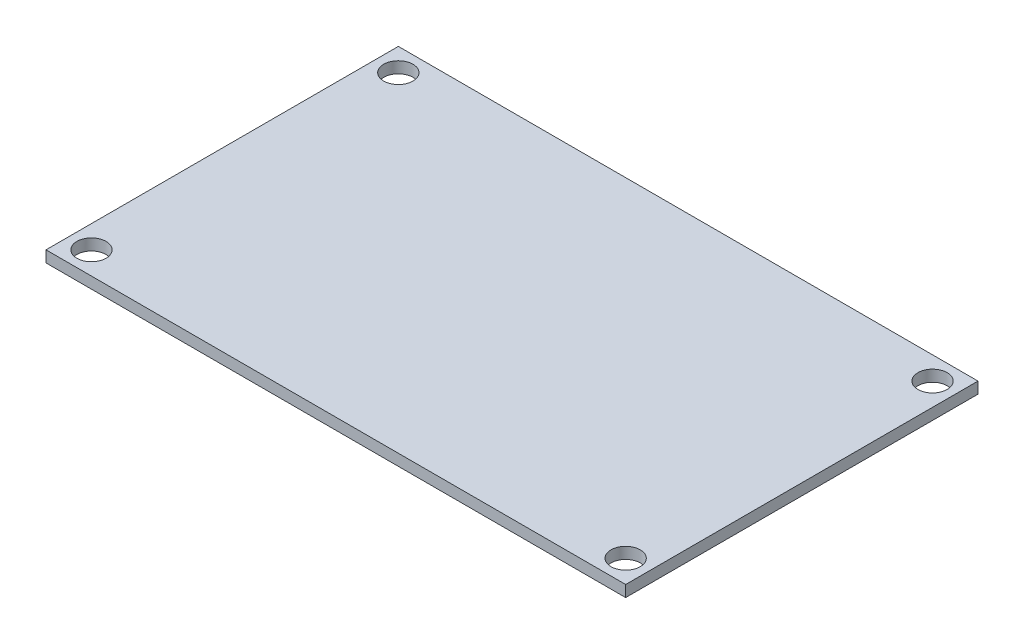
ISO-10303-21;
HEADER;
FILE_DESCRIPTION(('STEP AP214'),'2;1');
FILE_NAME('part.step','',(''),(''),'','','');
FILE_SCHEMA(('AUTOMOTIVE_DESIGN { 1 0 10303 214 1 1 1 1 }'));
ENDSEC;
DATA;
#1=APPLICATION_CONTEXT('core data for automotive mechanical design processes');
#2=APPLICATION_PROTOCOL_DEFINITION('international standard','automotive_design',2000,#1);
#3=PRODUCT_CONTEXT('',#1,'mechanical');
#4=PRODUCT('Part','Part','',(#3));
#5=PRODUCT_RELATED_PRODUCT_CATEGORY('part','',(#4));
#6=PRODUCT_DEFINITION_FORMATION('','',#4);
#7=PRODUCT_DEFINITION_CONTEXT('part definition',#1,'design');
#8=PRODUCT_DEFINITION('design','',#6,#7);
#9=PRODUCT_DEFINITION_SHAPE('','',#8);
#10=(LENGTH_UNIT() NAMED_UNIT(*) SI_UNIT(.MILLI.,.METRE.));
#11=(NAMED_UNIT(*) PLANE_ANGLE_UNIT() SI_UNIT($,.RADIAN.));
#12=(NAMED_UNIT(*) SI_UNIT($,.STERADIAN.) SOLID_ANGLE_UNIT());
#13=UNCERTAINTY_MEASURE_WITH_UNIT(LENGTH_MEASURE(1.E-05),#10,'distance_accuracy_value','');
#14=(GEOMETRIC_REPRESENTATION_CONTEXT(3) GLOBAL_UNCERTAINTY_ASSIGNED_CONTEXT((#13)) GLOBAL_UNIT_ASSIGNED_CONTEXT((#10,
#11,#12)) REPRESENTATION_CONTEXT('',''));
#15=CARTESIAN_POINT('',(0.,0.,0.));
#16=DIRECTION('',(0.,0.,1.));
#17=DIRECTION('',(1.,0.,0.));
#18=AXIS2_PLACEMENT_3D('',#15,#16,#17);
#19=CARTESIAN_POINT('',(32.385,1.27,19.685));
#20=DIRECTION('',(-1.,0.,0.));
#21=DIRECTION('',(0.,0.,1.));
#22=AXIS2_PLACEMENT_3D('',#19,#20,#21);
#23=PLANE('',#22);
#24=DIRECTION('',(0.,0.,-1.));
#25=VECTOR('',#24,1.);
#26=CARTESIAN_POINT('',(32.385,0.,19.685));
#27=LINE('',#26,#25);
#28=CARTESIAN_POINT('',(32.385,0.,19.685));
#29=VERTEX_POINT('',#28);
#30=CARTESIAN_POINT('',(32.385,0.,-19.685));
#31=VERTEX_POINT('',#30);
#32=EDGE_CURVE('E97',#29,#31,#27,.T.);
#33=ORIENTED_EDGE('',*,*,#32,.T.);
#34=DIRECTION('',(0.,-1.,0.));
#35=VECTOR('',#34,1.);
#36=CARTESIAN_POINT('',(32.385,1.27,-19.685));
#37=LINE('',#36,#35);
#38=CARTESIAN_POINT('',(32.385,1.27,-19.685));
#39=VERTEX_POINT('',#38);
#40=EDGE_CURVE('E11',#39,#31,#37,.T.);
#41=ORIENTED_EDGE('',*,*,#40,.F.);
#42=DIRECTION('',(0.,0.,-1.));
#43=VECTOR('',#42,1.);
#44=CARTESIAN_POINT('',(32.385,1.27,19.685));
#45=LINE('',#44,#43);
#46=CARTESIAN_POINT('',(32.385,1.27,19.685));
#47=VERTEX_POINT('',#46);
#48=EDGE_CURVE('E84',#47,#39,#45,.T.);
#49=ORIENTED_EDGE('',*,*,#48,.F.);
#50=DIRECTION('',(0.,-1.,0.));
#51=VECTOR('',#50,1.);
#52=CARTESIAN_POINT('',(32.385,1.27,19.685));
#53=LINE('',#52,#51);
#54=EDGE_CURVE('E93',#47,#29,#53,.T.);
#55=ORIENTED_EDGE('',*,*,#54,.T.);
#56=EDGE_LOOP('',(#33,#41,#49,#55));
#57=FACE_BOUND('',#56,.T.);
#58=ADVANCED_FACE('F32',(#57),#23,.F.);
#59=CARTESIAN_POINT('',(-32.385,1.27,-19.685));
#60=DIRECTION('',(0.,0.,1.));
#61=DIRECTION('',(1.,0.,0.));
#62=AXIS2_PLACEMENT_3D('',#59,#60,#61);
#63=PLANE('',#62);
#64=DIRECTION('',(-1.,0.,0.));
#65=VECTOR('',#64,1.);
#66=CARTESIAN_POINT('',(-32.385,0.,-19.685));
#67=LINE('',#66,#65);
#68=CARTESIAN_POINT('',(-32.385,0.,-19.685));
#69=VERTEX_POINT('',#68);
#70=EDGE_CURVE('E88',#31,#69,#67,.T.);
#71=ORIENTED_EDGE('',*,*,#70,.T.);
#72=DIRECTION('',(0.,-1.,0.));
#73=VECTOR('',#72,1.);
#74=CARTESIAN_POINT('',(-32.385,1.27,-19.685));
#75=LINE('',#74,#73);
#76=CARTESIAN_POINT('',(-32.385,1.27,-19.685));
#77=VERTEX_POINT('',#76);
#78=EDGE_CURVE('E41',#77,#69,#75,.T.);
#79=ORIENTED_EDGE('',*,*,#78,.F.);
#80=DIRECTION('',(-1.,0.,0.));
#81=VECTOR('',#80,1.);
#82=CARTESIAN_POINT('',(-32.385,1.27,-19.685));
#83=LINE('',#82,#81);
#84=EDGE_CURVE('E79',#39,#77,#83,.T.);
#85=ORIENTED_EDGE('',*,*,#84,.F.);
#86=ORIENTED_EDGE('',*,*,#40,.T.);
#87=EDGE_LOOP('',(#71,#79,#85,#86));
#88=FACE_BOUND('',#87,.T.);
#89=ADVANCED_FACE('F87',(#88),#63,.F.);
#90=CARTESIAN_POINT('',(-32.385,1.27,19.685));
#91=DIRECTION('',(1.,0.,0.));
#92=DIRECTION('',(0.,0.,-1.));
#93=AXIS2_PLACEMENT_3D('',#90,#91,#92);
#94=PLANE('',#93);
#95=DIRECTION('',(0.,0.,1.));
#96=VECTOR('',#95,1.);
#97=CARTESIAN_POINT('',(-32.385,0.,19.685));
#98=LINE('',#97,#96);
#99=CARTESIAN_POINT('',(-32.385,0.,19.685));
#100=VERTEX_POINT('',#99);
#101=EDGE_CURVE('E66',#69,#100,#98,.T.);
#102=ORIENTED_EDGE('',*,*,#101,.T.);
#103=DIRECTION('',(0.,-1.,0.));
#104=VECTOR('',#103,1.);
#105=CARTESIAN_POINT('',(-32.385,1.27,19.685));
#106=LINE('',#105,#104);
#107=CARTESIAN_POINT('',(-32.385,1.27,19.685));
#108=VERTEX_POINT('',#107);
#109=EDGE_CURVE('E89',#108,#100,#106,.T.);
#110=ORIENTED_EDGE('',*,*,#109,.F.);
#111=DIRECTION('',(0.,0.,1.));
#112=VECTOR('',#111,1.);
#113=CARTESIAN_POINT('',(-32.385,1.27,19.685));
#114=LINE('',#113,#112);
#115=EDGE_CURVE('E82',#77,#108,#114,.T.);
#116=ORIENTED_EDGE('',*,*,#115,.F.);
#117=ORIENTED_EDGE('',*,*,#78,.T.);
#118=EDGE_LOOP('',(#102,#110,#116,#117));
#119=FACE_BOUND('',#118,.T.);
#120=ADVANCED_FACE('F91',(#119),#94,.F.);
#121=CARTESIAN_POINT('',(-32.385,1.27,19.685));
#122=DIRECTION('',(0.,0.,-1.));
#123=DIRECTION('',(-1.,0.,0.));
#124=AXIS2_PLACEMENT_3D('',#121,#122,#123);
#125=PLANE('',#124);
#126=DIRECTION('',(1.,0.,0.));
#127=VECTOR('',#126,1.);
#128=CARTESIAN_POINT('',(-32.385,0.,19.685));
#129=LINE('',#128,#127);
#130=EDGE_CURVE('E72',#100,#29,#129,.T.);
#131=ORIENTED_EDGE('',*,*,#130,.T.);
#132=ORIENTED_EDGE('',*,*,#54,.F.);
#133=DIRECTION('',(1.,0.,0.));
#134=VECTOR('',#133,1.);
#135=CARTESIAN_POINT('',(-32.385,1.27,19.685));
#136=LINE('',#135,#134);
#137=EDGE_CURVE('E49',#108,#47,#136,.T.);
#138=ORIENTED_EDGE('',*,*,#137,.F.);
#139=ORIENTED_EDGE('',*,*,#109,.T.);
#140=EDGE_LOOP('',(#131,#132,#138,#139));
#141=FACE_BOUND('',#140,.T.);
#142=ADVANCED_FACE('F105',(#141),#125,.F.);
#143=CARTESIAN_POINT('',(0.,1.27,0.));
#144=DIRECTION('',(0.,-1.,0.));
#145=DIRECTION('',(0.,0.,-1.));
#146=AXIS2_PLACEMENT_3D('',#143,#144,#145);
#147=PLANE('',#146);
#148=CARTESIAN_POINT('',(-29.845,1.27,-17.145));
#149=DIRECTION('',(0.,1.,0.));
#150=DIRECTION('',(0.,0.,1.));
#151=AXIS2_PLACEMENT_3D('',#148,#149,#150);
#152=CIRCLE('',#151,1.63195);
#153=CARTESIAN_POINT('',(-29.845,1.27,-15.51305));
#154=VERTEX_POINT('',#153);
#155=EDGE_CURVE('E128',#154,#154,#152,.T.);
#156=ORIENTED_EDGE('',*,*,#155,.F.);
#157=EDGE_LOOP('',(#156));
#158=FACE_BOUND('',#157,.T.);
#159=CARTESIAN_POINT('',(-29.845,1.27,17.145));
#160=DIRECTION('',(0.,1.,0.));
#161=DIRECTION('',(0.,0.,1.));
#162=AXIS2_PLACEMENT_3D('',#159,#160,#161);
#163=CIRCLE('',#162,1.63195);
#164=CARTESIAN_POINT('',(-29.845,1.27,18.77695));
#165=VERTEX_POINT('',#164);
#166=EDGE_CURVE('E122',#165,#165,#163,.T.);
#167=ORIENTED_EDGE('',*,*,#166,.F.);
#168=EDGE_LOOP('',(#167));
#169=FACE_BOUND('',#168,.T.);
#170=CARTESIAN_POINT('',(29.845,1.27,17.145));
#171=DIRECTION('',(0.,1.,0.));
#172=DIRECTION('',(0.,0.,1.));
#173=AXIS2_PLACEMENT_3D('',#170,#171,#172);
#174=CIRCLE('',#173,1.63195);
#175=CARTESIAN_POINT('',(29.845,1.27,18.77695));
#176=VERTEX_POINT('',#175);
#177=EDGE_CURVE('E119',#176,#176,#174,.T.);
#178=ORIENTED_EDGE('',*,*,#177,.F.);
#179=EDGE_LOOP('',(#178));
#180=FACE_BOUND('',#179,.T.);
#181=CARTESIAN_POINT('',(29.845,1.27,-17.145));
#182=DIRECTION('',(0.,1.,0.));
#183=DIRECTION('',(0.,0.,1.));
#184=AXIS2_PLACEMENT_3D('',#181,#182,#183);
#185=CIRCLE('',#184,1.63195);
#186=CARTESIAN_POINT('',(29.845,1.27,-15.51305));
#187=VERTEX_POINT('',#186);
#188=EDGE_CURVE('E113',#187,#187,#185,.T.);
#189=ORIENTED_EDGE('',*,*,#188,.F.);
#190=EDGE_LOOP('',(#189));
#191=FACE_BOUND('',#190,.T.);
#192=ORIENTED_EDGE('',*,*,#48,.T.);
#193=ORIENTED_EDGE('',*,*,#84,.T.);
#194=ORIENTED_EDGE('',*,*,#115,.T.);
#195=ORIENTED_EDGE('',*,*,#137,.T.);
#196=EDGE_LOOP('',(#192,#193,#194,#195));
#197=FACE_BOUND('',#196,.T.);
#198=ADVANCED_FACE('F80',(#158,#169,#180,#191,#197),#147,.F.);
#199=CARTESIAN_POINT('',(0.,0.,0.));
#200=DIRECTION('',(0.,-1.,0.));
#201=DIRECTION('',(0.,0.,-1.));
#202=AXIS2_PLACEMENT_3D('',#199,#200,#201);
#203=PLANE('',#202);
#204=CARTESIAN_POINT('',(-29.845,0.,-17.145));
#205=DIRECTION('',(0.,-1.,0.));
#206=DIRECTION('',(0.,0.,-1.));
#207=AXIS2_PLACEMENT_3D('',#204,#205,#206);
#208=CIRCLE('',#207,1.63195);
#209=CARTESIAN_POINT('',(-29.845,0.,-18.77695));
#210=VERTEX_POINT('',#209);
#211=EDGE_CURVE('E125',#210,#210,#208,.T.);
#212=ORIENTED_EDGE('',*,*,#211,.F.);
#213=EDGE_LOOP('',(#212));
#214=FACE_BOUND('',#213,.T.);
#215=CARTESIAN_POINT('',(-29.845,0.,17.145));
#216=DIRECTION('',(0.,-1.,0.));
#217=DIRECTION('',(0.,0.,-1.));
#218=AXIS2_PLACEMENT_3D('',#215,#216,#217);
#219=CIRCLE('',#218,1.63195);
#220=CARTESIAN_POINT('',(-29.845,0.,15.51305));
#221=VERTEX_POINT('',#220);
#222=EDGE_CURVE('E35',#221,#221,#219,.T.);
#223=ORIENTED_EDGE('',*,*,#222,.F.);
#224=EDGE_LOOP('',(#223));
#225=FACE_BOUND('',#224,.T.);
#226=CARTESIAN_POINT('',(29.845,0.,17.145));
#227=DIRECTION('',(0.,-1.,0.));
#228=DIRECTION('',(0.,0.,-1.));
#229=AXIS2_PLACEMENT_3D('',#226,#227,#228);
#230=CIRCLE('',#229,1.63195);
#231=CARTESIAN_POINT('',(29.845,0.,15.51305));
#232=VERTEX_POINT('',#231);
#233=EDGE_CURVE('E116',#232,#232,#230,.T.);
#234=ORIENTED_EDGE('',*,*,#233,.F.);
#235=EDGE_LOOP('',(#234));
#236=FACE_BOUND('',#235,.T.);
#237=CARTESIAN_POINT('',(29.845,0.,-17.145));
#238=DIRECTION('',(0.,-1.,0.));
#239=DIRECTION('',(0.,0.,-1.));
#240=AXIS2_PLACEMENT_3D('',#237,#238,#239);
#241=CIRCLE('',#240,1.63195);
#242=CARTESIAN_POINT('',(29.845,0.,-18.77695));
#243=VERTEX_POINT('',#242);
#244=EDGE_CURVE('E100',#243,#243,#241,.T.);
#245=ORIENTED_EDGE('',*,*,#244,.F.);
#246=EDGE_LOOP('',(#245));
#247=FACE_BOUND('',#246,.T.);
#248=ORIENTED_EDGE('',*,*,#32,.F.);
#249=ORIENTED_EDGE('',*,*,#130,.F.);
#250=ORIENTED_EDGE('',*,*,#101,.F.);
#251=ORIENTED_EDGE('',*,*,#70,.F.);
#252=EDGE_LOOP('',(#248,#249,#250,#251));
#253=FACE_BOUND('',#252,.T.);
#254=ADVANCED_FACE('F108',(#214,#225,#236,#247,#253),#203,.T.);
#255=CARTESIAN_POINT('',(29.845,1.27,-17.145));
#256=DIRECTION('',(0.,1.,0.));
#257=DIRECTION('',(0.,0.,1.));
#258=AXIS2_PLACEMENT_3D('',#255,#256,#257);
#259=CYLINDRICAL_SURFACE('',#258,1.63195);
#260=ORIENTED_EDGE('',*,*,#244,.T.);
#261=EDGE_LOOP('',(#260));
#262=FACE_BOUND('',#261,.T.);
#263=ORIENTED_EDGE('',*,*,#188,.T.);
#264=EDGE_LOOP('',(#263));
#265=FACE_BOUND('',#264,.T.);
#266=ADVANCED_FACE('F143',(#262,#265),#259,.F.);
#267=CARTESIAN_POINT('',(29.845,1.27,17.145));
#268=DIRECTION('',(0.,1.,0.));
#269=DIRECTION('',(0.,0.,1.));
#270=AXIS2_PLACEMENT_3D('',#267,#268,#269);
#271=CYLINDRICAL_SURFACE('',#270,1.63195);
#272=ORIENTED_EDGE('',*,*,#233,.T.);
#273=EDGE_LOOP('',(#272));
#274=FACE_BOUND('',#273,.T.);
#275=ORIENTED_EDGE('',*,*,#177,.T.);
#276=EDGE_LOOP('',(#275));
#277=FACE_BOUND('',#276,.T.);
#278=ADVANCED_FACE('F145',(#274,#277),#271,.F.);
#279=CARTESIAN_POINT('',(-29.845,1.27,17.145));
#280=DIRECTION('',(0.,1.,0.));
#281=DIRECTION('',(0.,0.,1.));
#282=AXIS2_PLACEMENT_3D('',#279,#280,#281);
#283=CYLINDRICAL_SURFACE('',#282,1.63195);
#284=ORIENTED_EDGE('',*,*,#222,.T.);
#285=EDGE_LOOP('',(#284));
#286=FACE_BOUND('',#285,.T.);
#287=ORIENTED_EDGE('',*,*,#166,.T.);
#288=EDGE_LOOP('',(#287));
#289=FACE_BOUND('',#288,.T.);
#290=ADVANCED_FACE('F152',(#286,#289),#283,.F.);
#291=CARTESIAN_POINT('',(-29.845,1.27,-17.145));
#292=DIRECTION('',(0.,1.,0.));
#293=DIRECTION('',(0.,0.,1.));
#294=AXIS2_PLACEMENT_3D('',#291,#292,#293);
#295=CYLINDRICAL_SURFACE('',#294,1.63195);
#296=ORIENTED_EDGE('',*,*,#211,.T.);
#297=EDGE_LOOP('',(#296));
#298=FACE_BOUND('',#297,.T.);
#299=ORIENTED_EDGE('',*,*,#155,.T.);
#300=EDGE_LOOP('',(#299));
#301=FACE_BOUND('',#300,.T.);
#302=ADVANCED_FACE('F132',(#298,#301),#295,.F.);
#303=CLOSED_SHELL('',(#58,#89,#120,#142,#198,#254,#266,#278,#290,#302));
#304=MANIFOLD_SOLID_BREP('B2',#303);
#305=ADVANCED_BREP_SHAPE_REPRESENTATION('',(#18,#304),#14);
#306=SHAPE_DEFINITION_REPRESENTATION(#9,#305);
ENDSEC;
END-ISO-10303-21;
